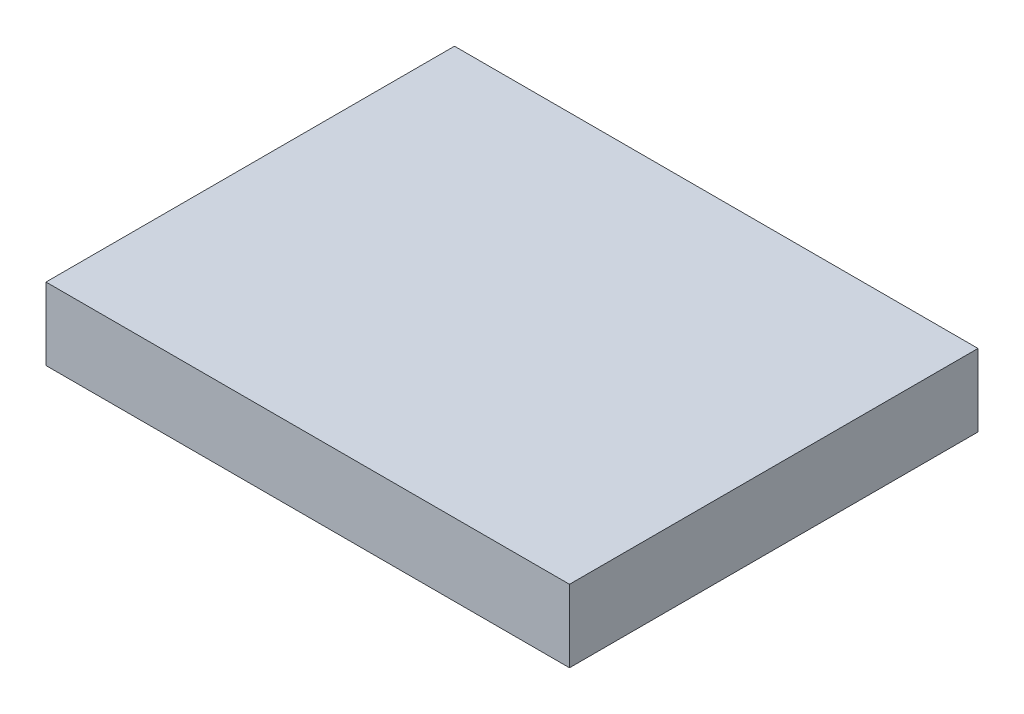
ISO-10303-21;
HEADER;
FILE_DESCRIPTION(('STEP AP214'),'2;1');
FILE_NAME('part.step','',(''),(''),'','','');
FILE_SCHEMA(('AUTOMOTIVE_DESIGN { 1 0 10303 214 1 1 1 1 }'));
ENDSEC;
DATA;
#1=APPLICATION_CONTEXT('core data for automotive mechanical design processes');
#2=APPLICATION_PROTOCOL_DEFINITION('international standard','automotive_design',2000,#1);
#3=PRODUCT_CONTEXT('',#1,'mechanical');
#4=PRODUCT('Part','Part','',(#3));
#5=PRODUCT_RELATED_PRODUCT_CATEGORY('part','',(#4));
#6=PRODUCT_DEFINITION_FORMATION('','',#4);
#7=PRODUCT_DEFINITION_CONTEXT('part definition',#1,'design');
#8=PRODUCT_DEFINITION('design','',#6,#7);
#9=PRODUCT_DEFINITION_SHAPE('','',#8);
#10=(LENGTH_UNIT() NAMED_UNIT(*) SI_UNIT(.MILLI.,.METRE.));
#11=(NAMED_UNIT(*) PLANE_ANGLE_UNIT() SI_UNIT($,.RADIAN.));
#12=(NAMED_UNIT(*) SI_UNIT($,.STERADIAN.) SOLID_ANGLE_UNIT());
#13=UNCERTAINTY_MEASURE_WITH_UNIT(LENGTH_MEASURE(1.E-05),#10,'distance_accuracy_value','');
#14=(GEOMETRIC_REPRESENTATION_CONTEXT(3) GLOBAL_UNCERTAINTY_ASSIGNED_CONTEXT((#13)) GLOBAL_UNIT_ASSIGNED_CONTEXT((#10,
#11,#12)) REPRESENTATION_CONTEXT('',''));
#15=CARTESIAN_POINT('',(0.,0.,0.));
#16=DIRECTION('',(0.,0.,1.));
#17=DIRECTION('',(1.,0.,0.));
#18=AXIS2_PLACEMENT_3D('',#15,#16,#17);
#19=CARTESIAN_POINT('',(-291.645231303906,-100.120893947725,-448.77976306599));
#20=DIRECTION('',(0.,0.,1.));
#21=DIRECTION('',(1.,0.,0.));
#22=AXIS2_PLACEMENT_3D('',#19,#20,#21);
#23=PLANE('',#22);
#24=DIRECTION('',(0.,-1.,0.));
#25=VECTOR('',#24,1.);
#26=CARTESIAN_POINT('',(-251.645231303906,-100.120893947724,-448.77976306599));
#27=LINE('',#26,#25);
#28=CARTESIAN_POINT('',(-251.645231303906,-100.120893947724,-448.77976306599));
#29=VERTEX_POINT('',#28);
#30=CARTESIAN_POINT('',(-251.645231303906,-105.648808584691,-448.77976306599));
#31=VERTEX_POINT('',#30);
#32=EDGE_CURVE('E98',#29,#31,#27,.T.);
#33=ORIENTED_EDGE('',*,*,#32,.T.);
#34=DIRECTION('',(1.,0.,0.));
#35=VECTOR('',#34,1.);
#36=CARTESIAN_POINT('',(-291.645231303906,-105.648808584691,-448.77976306599));
#37=LINE('',#36,#35);
#38=CARTESIAN_POINT('',(-291.645231303906,-105.648808584691,-448.77976306599));
#39=VERTEX_POINT('',#38);
#40=EDGE_CURVE('E11',#39,#31,#37,.T.);
#41=ORIENTED_EDGE('',*,*,#40,.F.);
#42=DIRECTION('',(0.,-1.,0.));
#43=VECTOR('',#42,1.);
#44=CARTESIAN_POINT('',(-291.645231303906,-100.120893947725,-448.77976306599));
#45=LINE('',#44,#43);
#46=CARTESIAN_POINT('',(-291.645231303906,-100.120893947725,-448.77976306599));
#47=VERTEX_POINT('',#46);
#48=EDGE_CURVE('E86',#47,#39,#45,.T.);
#49=ORIENTED_EDGE('',*,*,#48,.F.);
#50=DIRECTION('',(1.,0.,0.));
#51=VECTOR('',#50,1.);
#52=CARTESIAN_POINT('',(-291.645231303906,-100.120893947725,-448.77976306599));
#53=LINE('',#52,#51);
#54=EDGE_CURVE('E94',#47,#29,#53,.T.);
#55=ORIENTED_EDGE('',*,*,#54,.T.);
#56=EDGE_LOOP('',(#33,#41,#49,#55));
#57=FACE_BOUND('',#56,.T.);
#58=ADVANCED_FACE('F35',(#57),#23,.F.);
#59=CARTESIAN_POINT('',(-291.645231303906,-105.648808584691,-448.77976306599));
#60=DIRECTION('',(0.,1.,0.));
#61=DIRECTION('',(-1.,0.,0.));
#62=AXIS2_PLACEMENT_3D('',#59,#60,#61);
#63=PLANE('',#62);
#64=DIRECTION('',(0.,0.,1.));
#65=VECTOR('',#64,1.);
#66=CARTESIAN_POINT('',(-251.645231303906,-105.648808584691,-448.77976306599));
#67=LINE('',#66,#65);
#68=CARTESIAN_POINT('',(-251.645231303906,-105.648808584691,-417.56748124867));
#69=VERTEX_POINT('',#68);
#70=EDGE_CURVE('E90',#31,#69,#67,.T.);
#71=ORIENTED_EDGE('',*,*,#70,.T.);
#72=DIRECTION('',(1.,0.,0.));
#73=VECTOR('',#72,1.);
#74=CARTESIAN_POINT('',(-291.645231303906,-105.648808584691,-417.56748124867));
#75=LINE('',#74,#73);
#76=CARTESIAN_POINT('',(-291.645231303906,-105.648808584691,-417.56748124867));
#77=VERTEX_POINT('',#76);
#78=EDGE_CURVE('E43',#77,#69,#75,.T.);
#79=ORIENTED_EDGE('',*,*,#78,.F.);
#80=DIRECTION('',(0.,0.,1.));
#81=VECTOR('',#80,1.);
#82=CARTESIAN_POINT('',(-291.645231303906,-105.648808584691,-448.77976306599));
#83=LINE('',#82,#81);
#84=EDGE_CURVE('E81',#39,#77,#83,.T.);
#85=ORIENTED_EDGE('',*,*,#84,.F.);
#86=ORIENTED_EDGE('',*,*,#40,.T.);
#87=EDGE_LOOP('',(#71,#79,#85,#86));
#88=FACE_BOUND('',#87,.T.);
#89=ADVANCED_FACE('F89',(#88),#63,.F.);
#90=CARTESIAN_POINT('',(-291.645231303906,-100.120893947725,-417.56748124867));
#91=DIRECTION('',(0.,0.,-1.));
#92=DIRECTION('',(-1.,0.,0.));
#93=AXIS2_PLACEMENT_3D('',#90,#91,#92);
#94=PLANE('',#93);
#95=DIRECTION('',(0.,1.,0.));
#96=VECTOR('',#95,1.);
#97=CARTESIAN_POINT('',(-251.645231303906,-100.120893947724,-417.56748124867));
#98=LINE('',#97,#96);
#99=CARTESIAN_POINT('',(-251.645231303906,-100.120893947724,-417.56748124867));
#100=VERTEX_POINT('',#99);
#101=EDGE_CURVE('E68',#69,#100,#98,.T.);
#102=ORIENTED_EDGE('',*,*,#101,.T.);
#103=DIRECTION('',(1.,0.,0.));
#104=VECTOR('',#103,1.);
#105=CARTESIAN_POINT('',(-291.645231303906,-100.120893947725,-417.56748124867));
#106=LINE('',#105,#104);
#107=CARTESIAN_POINT('',(-291.645231303906,-100.120893947725,-417.56748124867));
#108=VERTEX_POINT('',#107);
#109=EDGE_CURVE('E91',#108,#100,#106,.T.);
#110=ORIENTED_EDGE('',*,*,#109,.F.);
#111=DIRECTION('',(0.,1.,0.));
#112=VECTOR('',#111,1.);
#113=CARTESIAN_POINT('',(-291.645231303906,-100.120893947725,-417.56748124867));
#114=LINE('',#113,#112);
#115=EDGE_CURVE('E84',#77,#108,#114,.T.);
#116=ORIENTED_EDGE('',*,*,#115,.F.);
#117=ORIENTED_EDGE('',*,*,#78,.T.);
#118=EDGE_LOOP('',(#102,#110,#116,#117));
#119=FACE_BOUND('',#118,.T.);
#120=ADVANCED_FACE('F92',(#119),#94,.F.);
#121=CARTESIAN_POINT('',(-291.645231303906,-100.120893947725,-448.77976306599));
#122=DIRECTION('',(0.,-1.,0.));
#123=DIRECTION('',(1.,0.,0.));
#124=AXIS2_PLACEMENT_3D('',#121,#122,#123);
#125=PLANE('',#124);
#126=DIRECTION('',(0.,0.,-1.));
#127=VECTOR('',#126,1.);
#128=CARTESIAN_POINT('',(-251.645231303906,-100.120893947724,-448.77976306599));
#129=LINE('',#128,#127);
#130=EDGE_CURVE('E74',#100,#29,#129,.T.);
#131=ORIENTED_EDGE('',*,*,#130,.T.);
#132=ORIENTED_EDGE('',*,*,#54,.F.);
#133=DIRECTION('',(0.,0.,-1.));
#134=VECTOR('',#133,1.);
#135=CARTESIAN_POINT('',(-291.645231303906,-100.120893947725,-448.77976306599));
#136=LINE('',#135,#134);
#137=EDGE_CURVE('E51',#108,#47,#136,.T.);
#138=ORIENTED_EDGE('',*,*,#137,.F.);
#139=ORIENTED_EDGE('',*,*,#109,.T.);
#140=EDGE_LOOP('',(#131,#132,#138,#139));
#141=FACE_BOUND('',#140,.T.);
#142=ADVANCED_FACE('F105',(#141),#125,.F.);
#143=CARTESIAN_POINT('',(-291.645231303906,-2.79318507107451E-13,0.));
#144=DIRECTION('',(-1.,0.,0.));
#145=DIRECTION('',(0.,0.,1.));
#146=AXIS2_PLACEMENT_3D('',#143,#144,#145);
#147=PLANE('',#146);
#148=ORIENTED_EDGE('',*,*,#48,.T.);
#149=ORIENTED_EDGE('',*,*,#84,.T.);
#150=ORIENTED_EDGE('',*,*,#115,.T.);
#151=ORIENTED_EDGE('',*,*,#137,.T.);
#152=EDGE_LOOP('',(#148,#149,#150,#151));
#153=FACE_BOUND('',#152,.T.);
#154=ADVANCED_FACE('F82',(#153),#147,.T.);
#155=CARTESIAN_POINT('',(-251.645231303906,0.,0.));
#156=DIRECTION('',(-1.,0.,0.));
#157=DIRECTION('',(0.,0.,1.));
#158=AXIS2_PLACEMENT_3D('',#155,#156,#157);
#159=PLANE('',#158);
#160=ORIENTED_EDGE('',*,*,#32,.F.);
#161=ORIENTED_EDGE('',*,*,#130,.F.);
#162=ORIENTED_EDGE('',*,*,#101,.F.);
#163=ORIENTED_EDGE('',*,*,#70,.F.);
#164=EDGE_LOOP('',(#160,#161,#162,#163));
#165=FACE_BOUND('',#164,.T.);
#166=ADVANCED_FACE('F108',(#165),#159,.F.);
#167=CLOSED_SHELL('',(#58,#89,#120,#142,#154,#166));
#168=MANIFOLD_SOLID_BREP('B2',#167);
#169=ADVANCED_BREP_SHAPE_REPRESENTATION('',(#18,#168),#14);
#170=SHAPE_DEFINITION_REPRESENTATION(#9,#169);
ENDSEC;
END-ISO-10303-21;
